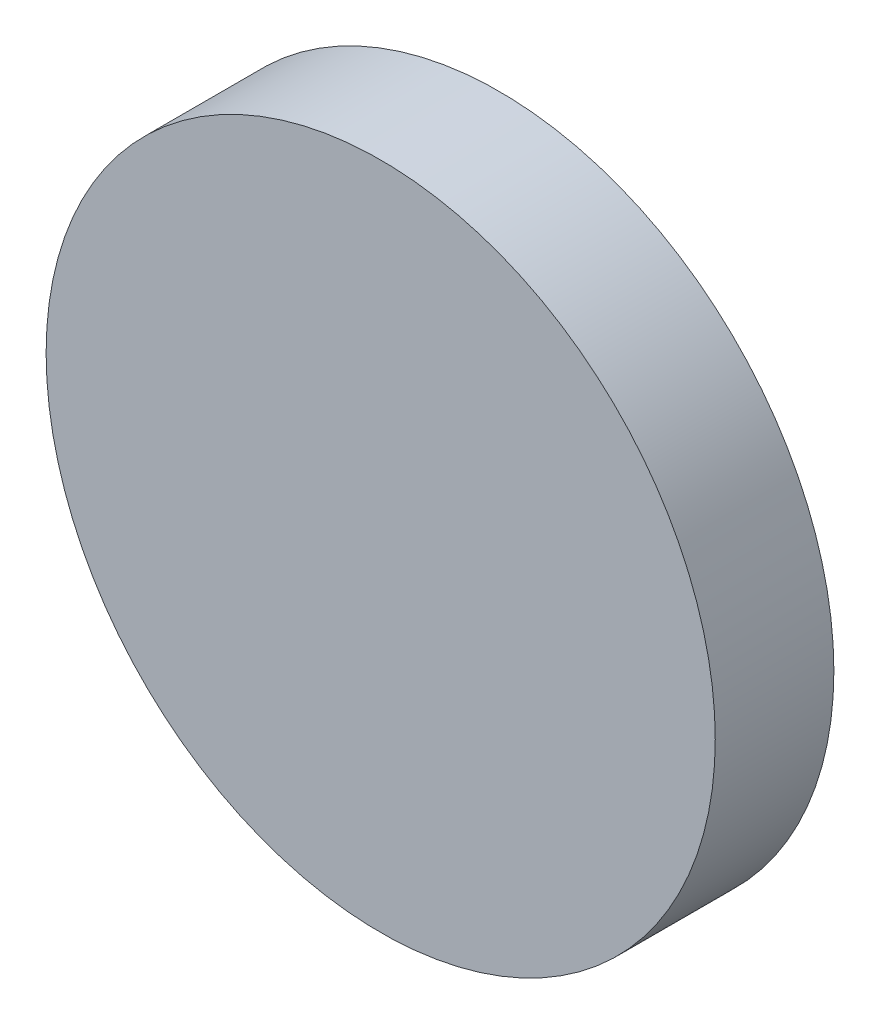
ISO-10303-21;
HEADER;
FILE_DESCRIPTION(('STEP AP214'),'2;1');
FILE_NAME('part.step','',(''),(''),'','','');
FILE_SCHEMA(('AUTOMOTIVE_DESIGN { 1 0 10303 214 1 1 1 1 }'));
ENDSEC;
DATA;
#1=APPLICATION_CONTEXT('core data for automotive mechanical design processes');
#2=APPLICATION_PROTOCOL_DEFINITION('international standard','automotive_design',2000,#1);
#3=PRODUCT_CONTEXT('',#1,'mechanical');
#4=PRODUCT('Part','Part','',(#3));
#5=PRODUCT_RELATED_PRODUCT_CATEGORY('part','',(#4));
#6=PRODUCT_DEFINITION_FORMATION('','',#4);
#7=PRODUCT_DEFINITION_CONTEXT('part definition',#1,'design');
#8=PRODUCT_DEFINITION('design','',#6,#7);
#9=PRODUCT_DEFINITION_SHAPE('','',#8);
#10=(LENGTH_UNIT() NAMED_UNIT(*) SI_UNIT(.MILLI.,.METRE.));
#11=(NAMED_UNIT(*) PLANE_ANGLE_UNIT() SI_UNIT($,.RADIAN.));
#12=(NAMED_UNIT(*) SI_UNIT($,.STERADIAN.) SOLID_ANGLE_UNIT());
#13=UNCERTAINTY_MEASURE_WITH_UNIT(LENGTH_MEASURE(1.E-05),#10,'distance_accuracy_value','');
#14=(GEOMETRIC_REPRESENTATION_CONTEXT(3) GLOBAL_UNCERTAINTY_ASSIGNED_CONTEXT((#13)) GLOBAL_UNIT_ASSIGNED_CONTEXT((#10,
#11,#12)) REPRESENTATION_CONTEXT('',''));
#15=CARTESIAN_POINT('',(0.,0.,0.));
#16=DIRECTION('',(0.,0.,1.));
#17=DIRECTION('',(1.,0.,0.));
#18=AXIS2_PLACEMENT_3D('',#15,#16,#17);
#19=CARTESIAN_POINT('',(0.,0.,3.9));
#20=DIRECTION('',(0.,0.,-1.));
#21=DIRECTION('',(-1.,0.,0.));
#22=AXIS2_PLACEMENT_3D('',#19,#20,#21);
#23=CYLINDRICAL_SURFACE('',#22,11.);
#24=CARTESIAN_POINT('',(0.,0.,3.9));
#25=DIRECTION('',(0.,0.,1.));
#26=DIRECTION('',(1.,0.,0.));
#27=AXIS2_PLACEMENT_3D('',#24,#25,#26);
#28=CIRCLE('',#27,11.);
#29=CARTESIAN_POINT('',(11.,0.,3.9));
#30=VERTEX_POINT('',#29);
#31=EDGE_CURVE('E10',#30,#30,#28,.T.);
#32=ORIENTED_EDGE('',*,*,#31,.F.);
#33=EDGE_LOOP('',(#32));
#34=FACE_BOUND('',#33,.T.);
#35=CARTESIAN_POINT('',(0.,0.,0.));
#36=DIRECTION('',(0.,0.,1.));
#37=DIRECTION('',(1.,0.,0.));
#38=AXIS2_PLACEMENT_3D('',#35,#36,#37);
#39=CIRCLE('',#38,11.);
#40=CARTESIAN_POINT('',(11.,0.,0.));
#41=VERTEX_POINT('',#40);
#42=EDGE_CURVE('E37',#41,#41,#39,.T.);
#43=ORIENTED_EDGE('',*,*,#42,.T.);
#44=EDGE_LOOP('',(#43));
#45=FACE_BOUND('',#44,.T.);
#46=ADVANCED_FACE('F34',(#34,#45),#23,.T.);
#47=CARTESIAN_POINT('',(0.,0.,3.9));
#48=DIRECTION('',(0.,0.,1.));
#49=DIRECTION('',(1.,0.,0.));
#50=AXIS2_PLACEMENT_3D('',#47,#48,#49);
#51=PLANE('',#50);
#52=ORIENTED_EDGE('',*,*,#31,.T.);
#53=EDGE_LOOP('',(#52));
#54=FACE_BOUND('',#53,.T.);
#55=ADVANCED_FACE('F49',(#54),#51,.T.);
#56=CARTESIAN_POINT('',(0.,0.,0.));
#57=DIRECTION('',(0.,0.,1.));
#58=DIRECTION('',(1.,0.,0.));
#59=AXIS2_PLACEMENT_3D('',#56,#57,#58);
#60=PLANE('',#59);
#61=ORIENTED_EDGE('',*,*,#42,.F.);
#62=EDGE_LOOP('',(#61));
#63=FACE_BOUND('',#62,.T.);
#64=ADVANCED_FACE('F47',(#63),#60,.F.);
#65=CLOSED_SHELL('',(#46,#55,#64));
#66=MANIFOLD_SOLID_BREP('B2',#65);
#67=ADVANCED_BREP_SHAPE_REPRESENTATION('',(#18,#66),#14);
#68=SHAPE_DEFINITION_REPRESENTATION(#9,#67);
ENDSEC;
END-ISO-10303-21;
